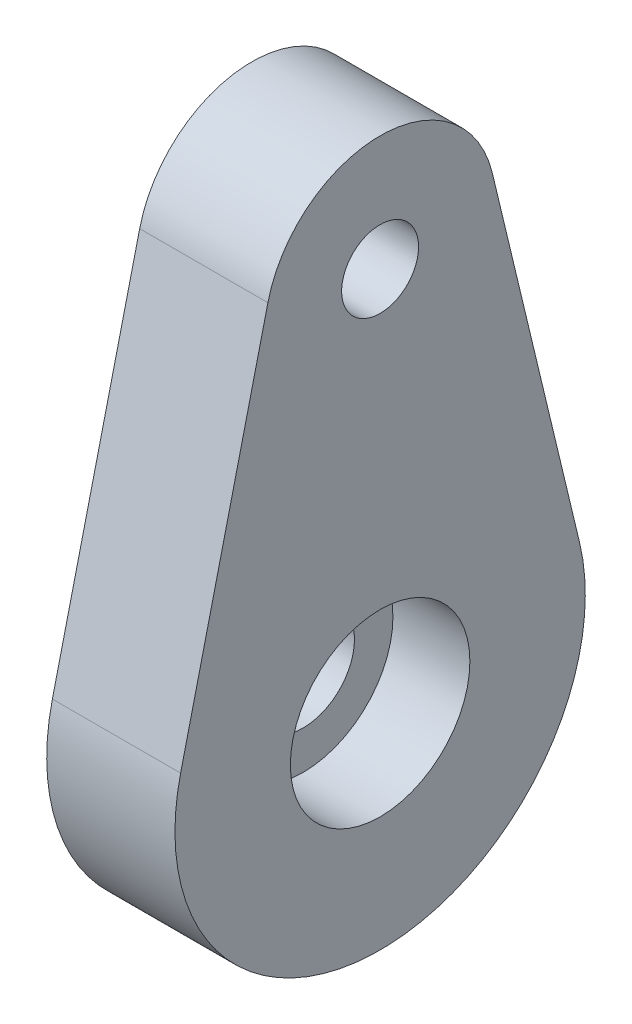
ISO-10303-21;
HEADER;
FILE_DESCRIPTION(('STEP AP214'),'2;1');
FILE_NAME('part.step','',(''),(''),'','','');
FILE_SCHEMA(('AUTOMOTIVE_DESIGN { 1 0 10303 214 1 1 1 1 }'));
ENDSEC;
DATA;
#1=APPLICATION_CONTEXT('core data for automotive mechanical design processes');
#2=APPLICATION_PROTOCOL_DEFINITION('international standard','automotive_design',2000,#1);
#3=PRODUCT_CONTEXT('',#1,'mechanical');
#4=PRODUCT('Part','Part','',(#3));
#5=PRODUCT_RELATED_PRODUCT_CATEGORY('part','',(#4));
#6=PRODUCT_DEFINITION_FORMATION('','',#4);
#7=PRODUCT_DEFINITION_CONTEXT('part definition',#1,'design');
#8=PRODUCT_DEFINITION('design','',#6,#7);
#9=PRODUCT_DEFINITION_SHAPE('','',#8);
#10=(LENGTH_UNIT() NAMED_UNIT(*) SI_UNIT(.MILLI.,.METRE.));
#11=(NAMED_UNIT(*) PLANE_ANGLE_UNIT() SI_UNIT($,.RADIAN.));
#12=(NAMED_UNIT(*) SI_UNIT($,.STERADIAN.) SOLID_ANGLE_UNIT());
#13=UNCERTAINTY_MEASURE_WITH_UNIT(LENGTH_MEASURE(1.E-05),#10,'distance_accuracy_value','');
#14=(GEOMETRIC_REPRESENTATION_CONTEXT(3) GLOBAL_UNCERTAINTY_ASSIGNED_CONTEXT((#13)) GLOBAL_UNIT_ASSIGNED_CONTEXT((#10,
#11,#12)) REPRESENTATION_CONTEXT('',''));
#15=CARTESIAN_POINT('',(0.,0.,0.));
#16=DIRECTION('',(0.,0.,1.));
#17=DIRECTION('',(1.,0.,0.));
#18=AXIS2_PLACEMENT_3D('',#15,#16,#17);
#19=CARTESIAN_POINT('',(5.,0.,0.));
#20=DIRECTION('',(-1.,0.,0.));
#21=DIRECTION('',(0.,0.,1.));
#22=AXIS2_PLACEMENT_3D('',#19,#20,#21);
#23=CYLINDRICAL_SURFACE('',#22,2.);
#24=CARTESIAN_POINT('',(-0.5,0.,0.));
#25=DIRECTION('',(-1.,0.,0.));
#26=DIRECTION('',(0.,0.,1.));
#27=AXIS2_PLACEMENT_3D('',#24,#25,#26);
#28=CIRCLE('',#27,2.);
#29=CARTESIAN_POINT('',(-0.5,0.,2.));
#30=VERTEX_POINT('',#29);
#31=EDGE_CURVE('E215',#30,#30,#28,.T.);
#32=ORIENTED_EDGE('',*,*,#31,.T.);
#33=EDGE_LOOP('',(#32));
#34=FACE_BOUND('',#33,.T.);
#35=CARTESIAN_POINT('',(2.,0.,0.));
#36=DIRECTION('',(1.,0.,0.));
#37=DIRECTION('',(0.,0.,-1.));
#38=AXIS2_PLACEMENT_3D('',#35,#36,#37);
#39=CIRCLE('',#38,2.);
#40=CARTESIAN_POINT('',(2.,0.,-2.));
#41=VERTEX_POINT('',#40);
#42=EDGE_CURVE('E211',#41,#41,#39,.T.);
#43=ORIENTED_EDGE('',*,*,#42,.T.);
#44=EDGE_LOOP('',(#43));
#45=FACE_BOUND('',#44,.T.);
#46=ADVANCED_FACE('F34',(#34,#45),#23,.F.);
#47=CARTESIAN_POINT('',(0.,0.,0.));
#48=DIRECTION('',(1.,0.,0.));
#49=DIRECTION('',(0.,0.,-1.));
#50=AXIS2_PLACEMENT_3D('',#47,#48,#49);
#51=PLANE('',#50);
#52=CARTESIAN_POINT('',(0.,15.,0.));
#53=DIRECTION('',(1.,0.,0.));
#54=DIRECTION('',(0.,0.,-1.));
#55=AXIS2_PLACEMENT_3D('',#52,#53,#54);
#56=CIRCLE('',#55,1.5);
#57=CARTESIAN_POINT('',(0.,15.,-1.5));
#58=VERTEX_POINT('',#57);
#59=EDGE_CURVE('E226',#58,#58,#56,.T.);
#60=ORIENTED_EDGE('',*,*,#59,.T.);
#61=EDGE_LOOP('',(#60));
#62=FACE_BOUND('',#61,.T.);
#63=CARTESIAN_POINT('',(0.,0.,0.));
#64=DIRECTION('',(1.,0.,0.));
#65=DIRECTION('',(0.,0.,-1.));
#66=AXIS2_PLACEMENT_3D('',#63,#64,#65);
#67=CIRCLE('',#66,8.);
#68=CARTESIAN_POINT('',(0.,1.86666666666667,7.7791744777679));
#69=VERTEX_POINT('',#68);
#70=CARTESIAN_POINT('',(0.,1.86666666666667,-7.77917447776791));
#71=VERTEX_POINT('',#70);
#72=EDGE_CURVE('E102',#69,#71,#67,.T.);
#73=ORIENTED_EDGE('',*,*,#72,.F.);
#74=DIRECTION('',(0.,-0.972396809720988,0.233333333333333));
#75=VECTOR('',#74,1.);
#76=CARTESIAN_POINT('',(0.,1.86666666666667,7.7791744777679));
#77=LINE('',#76,#75);
#78=CARTESIAN_POINT('',(0.,16.05,4.37578564374444));
#79=VERTEX_POINT('',#78);
#80=EDGE_CURVE('E74',#79,#69,#77,.T.);
#81=ORIENTED_EDGE('',*,*,#80,.F.);
#82=CARTESIAN_POINT('',(0.,15.,0.));
#83=DIRECTION('',(1.,0.,0.));
#84=DIRECTION('',(0.,0.,-1.));
#85=AXIS2_PLACEMENT_3D('',#82,#83,#84);
#86=CIRCLE('',#85,4.5);
#87=CARTESIAN_POINT('',(0.,16.05,-4.37578564374445));
#88=VERTEX_POINT('',#87);
#89=EDGE_CURVE('E68',#88,#79,#86,.T.);
#90=ORIENTED_EDGE('',*,*,#89,.F.);
#91=DIRECTION('',(0.,0.972396809720988,0.233333333333333));
#92=VECTOR('',#91,1.);
#93=CARTESIAN_POINT('',(0.,16.05,-4.37578564374445));
#94=LINE('',#93,#92);
#95=EDGE_CURVE('E93',#71,#88,#94,.T.);
#96=ORIENTED_EDGE('',*,*,#95,.F.);
#97=EDGE_LOOP('',(#73,#81,#90,#96));
#98=FACE_BOUND('',#97,.T.);
#99=CARTESIAN_POINT('',(0.,0.,0.));
#100=DIRECTION('',(1.,0.,0.));
#101=DIRECTION('',(0.,0.,-1.));
#102=AXIS2_PLACEMENT_3D('',#99,#100,#101);
#103=CIRCLE('',#102,3.);
#104=CARTESIAN_POINT('',(0.,0.,-3.));
#105=VERTEX_POINT('',#104);
#106=EDGE_CURVE('E11',#105,#105,#103,.F.);
#107=ORIENTED_EDGE('',*,*,#106,.F.);
#108=EDGE_LOOP('',(#107));
#109=FACE_BOUND('',#108,.T.);
#110=ADVANCED_FACE('F113',(#62,#98,#109),#51,.F.);
#111=CARTESIAN_POINT('',(5.,0.,0.));
#112=DIRECTION('',(1.,0.,0.));
#113=DIRECTION('',(0.,0.,-1.));
#114=AXIS2_PLACEMENT_3D('',#111,#112,#113);
#115=PLANE('',#114);
#116=CARTESIAN_POINT('',(5.,0.,0.));
#117=DIRECTION('',(1.,0.,0.));
#118=DIRECTION('',(0.,0.,-1.));
#119=AXIS2_PLACEMENT_3D('',#116,#117,#118);
#120=CIRCLE('',#119,3.5);
#121=CARTESIAN_POINT('',(5.,0.,-3.5));
#122=VERTEX_POINT('',#121);
#123=EDGE_CURVE('E216',#122,#122,#120,.T.);
#124=ORIENTED_EDGE('',*,*,#123,.F.);
#125=EDGE_LOOP('',(#124));
#126=FACE_BOUND('',#125,.T.);
#127=CARTESIAN_POINT('',(5.,0.,0.));
#128=DIRECTION('',(1.,0.,0.));
#129=DIRECTION('',(0.,0.,-1.));
#130=AXIS2_PLACEMENT_3D('',#127,#128,#129);
#131=CIRCLE('',#130,8.);
#132=CARTESIAN_POINT('',(5.,1.86666666666667,7.7791744777679));
#133=VERTEX_POINT('',#132);
#134=CARTESIAN_POINT('',(5.,1.86666666666667,-7.77917447776791));
#135=VERTEX_POINT('',#134);
#136=EDGE_CURVE('E88',#133,#135,#131,.T.);
#137=ORIENTED_EDGE('',*,*,#136,.T.);
#138=DIRECTION('',(0.,0.972396809720988,0.233333333333333));
#139=VECTOR('',#138,1.);
#140=CARTESIAN_POINT('',(5.,16.05,-4.37578564374445));
#141=LINE('',#140,#139);
#142=CARTESIAN_POINT('',(5.,16.05,-4.37578564374445));
#143=VERTEX_POINT('',#142);
#144=EDGE_CURVE('E82',#135,#143,#141,.T.);
#145=ORIENTED_EDGE('',*,*,#144,.T.);
#146=CARTESIAN_POINT('',(5.,15.,0.));
#147=DIRECTION('',(1.,0.,0.));
#148=DIRECTION('',(0.,0.,-1.));
#149=AXIS2_PLACEMENT_3D('',#146,#147,#148);
#150=CIRCLE('',#149,4.5);
#151=CARTESIAN_POINT('',(5.,16.05,4.37578564374444));
#152=VERTEX_POINT('',#151);
#153=EDGE_CURVE('E86',#143,#152,#150,.T.);
#154=ORIENTED_EDGE('',*,*,#153,.T.);
#155=DIRECTION('',(0.,-0.972396809720988,0.233333333333333));
#156=VECTOR('',#155,1.);
#157=CARTESIAN_POINT('',(5.,1.86666666666667,7.7791744777679));
#158=LINE('',#157,#156);
#159=EDGE_CURVE('E51',#152,#133,#158,.T.);
#160=ORIENTED_EDGE('',*,*,#159,.T.);
#161=EDGE_LOOP('',(#137,#145,#154,#160));
#162=FACE_BOUND('',#161,.T.);
#163=CARTESIAN_POINT('',(5.,15.,0.));
#164=DIRECTION('',(1.,0.,0.));
#165=DIRECTION('',(0.,0.,-1.));
#166=AXIS2_PLACEMENT_3D('',#163,#164,#165);
#167=CIRCLE('',#166,1.5);
#168=CARTESIAN_POINT('',(5.,15.,-1.5));
#169=VERTEX_POINT('',#168);
#170=EDGE_CURVE('E105',#169,#169,#167,.T.);
#171=ORIENTED_EDGE('',*,*,#170,.F.);
#172=EDGE_LOOP('',(#171));
#173=FACE_BOUND('',#172,.T.);
#174=ADVANCED_FACE('F83',(#126,#162,#173),#115,.T.);
#175=CARTESIAN_POINT('',(5.,0.,0.));
#176=DIRECTION('',(-1.,0.,0.));
#177=DIRECTION('',(0.,0.,1.));
#178=AXIS2_PLACEMENT_3D('',#175,#176,#177);
#179=CYLINDRICAL_SURFACE('',#178,8.);
#180=ORIENTED_EDGE('',*,*,#72,.T.);
#181=DIRECTION('',(-1.,0.,0.));
#182=VECTOR('',#181,1.);
#183=CARTESIAN_POINT('',(5.,1.86666666666667,-7.77917447776791));
#184=LINE('',#183,#182);
#185=EDGE_CURVE('E43',#135,#71,#184,.T.);
#186=ORIENTED_EDGE('',*,*,#185,.F.);
#187=ORIENTED_EDGE('',*,*,#136,.F.);
#188=DIRECTION('',(-1.,0.,0.));
#189=VECTOR('',#188,1.);
#190=CARTESIAN_POINT('',(5.,1.86666666666667,7.7791744777679));
#191=LINE('',#190,#189);
#192=EDGE_CURVE('E98',#133,#69,#191,.T.);
#193=ORIENTED_EDGE('',*,*,#192,.T.);
#194=EDGE_LOOP('',(#180,#186,#187,#193));
#195=FACE_BOUND('',#194,.T.);
#196=ADVANCED_FACE('F36',(#195),#179,.T.);
#197=CARTESIAN_POINT('',(5.,16.05,-4.37578564374445));
#198=DIRECTION('',(0.,-0.233333333333333,0.972396809720988));
#199=DIRECTION('',(0.,-0.972396809720988,-0.233333333333333));
#200=AXIS2_PLACEMENT_3D('',#197,#198,#199);
#201=PLANE('',#200);
#202=ORIENTED_EDGE('',*,*,#95,.T.);
#203=DIRECTION('',(-1.,0.,0.));
#204=VECTOR('',#203,1.);
#205=CARTESIAN_POINT('',(5.,16.05,-4.37578564374445));
#206=LINE('',#205,#204);
#207=EDGE_CURVE('E91',#143,#88,#206,.T.);
#208=ORIENTED_EDGE('',*,*,#207,.F.);
#209=ORIENTED_EDGE('',*,*,#144,.F.);
#210=ORIENTED_EDGE('',*,*,#185,.T.);
#211=EDGE_LOOP('',(#202,#208,#209,#210));
#212=FACE_BOUND('',#211,.T.);
#213=ADVANCED_FACE('F92',(#212),#201,.F.);
#214=CARTESIAN_POINT('',(5.,15.,0.));
#215=DIRECTION('',(-1.,0.,0.));
#216=DIRECTION('',(0.,0.,1.));
#217=AXIS2_PLACEMENT_3D('',#214,#215,#216);
#218=CYLINDRICAL_SURFACE('',#217,4.5);
#219=ORIENTED_EDGE('',*,*,#89,.T.);
#220=DIRECTION('',(-1.,0.,0.));
#221=VECTOR('',#220,1.);
#222=CARTESIAN_POINT('',(5.,16.05,4.37578564374444));
#223=LINE('',#222,#221);
#224=EDGE_CURVE('E94',#152,#79,#223,.T.);
#225=ORIENTED_EDGE('',*,*,#224,.F.);
#226=ORIENTED_EDGE('',*,*,#153,.F.);
#227=ORIENTED_EDGE('',*,*,#207,.T.);
#228=EDGE_LOOP('',(#219,#225,#226,#227));
#229=FACE_BOUND('',#228,.T.);
#230=ADVANCED_FACE('F96',(#229),#218,.T.);
#231=CARTESIAN_POINT('',(5.,1.86666666666667,7.7791744777679));
#232=DIRECTION('',(0.,-0.233333333333333,-0.972396809720988));
#233=DIRECTION('',(0.,0.972396809720988,-0.233333333333333));
#234=AXIS2_PLACEMENT_3D('',#231,#232,#233);
#235=PLANE('',#234);
#236=ORIENTED_EDGE('',*,*,#80,.T.);
#237=ORIENTED_EDGE('',*,*,#192,.F.);
#238=ORIENTED_EDGE('',*,*,#159,.F.);
#239=ORIENTED_EDGE('',*,*,#224,.T.);
#240=EDGE_LOOP('',(#236,#237,#238,#239));
#241=FACE_BOUND('',#240,.T.);
#242=ADVANCED_FACE('F149',(#241),#235,.F.);
#243=CARTESIAN_POINT('',(5.,15.,0.));
#244=DIRECTION('',(-1.,0.,0.));
#245=DIRECTION('',(0.,0.,1.));
#246=AXIS2_PLACEMENT_3D('',#243,#244,#245);
#247=CYLINDRICAL_SURFACE('',#246,1.5);
#248=ORIENTED_EDGE('',*,*,#170,.T.);
#249=EDGE_LOOP('',(#248));
#250=FACE_BOUND('',#249,.T.);
#251=ORIENTED_EDGE('',*,*,#59,.F.);
#252=EDGE_LOOP('',(#251));
#253=FACE_BOUND('',#252,.T.);
#254=ADVANCED_FACE('F133',(#250,#253),#247,.F.);
#255=CARTESIAN_POINT('',(-0.5,0.,0.));
#256=DIRECTION('',(-1.,0.,0.));
#257=DIRECTION('',(0.,0.,1.));
#258=AXIS2_PLACEMENT_3D('',#255,#256,#257);
#259=PLANE('',#258);
#260=CARTESIAN_POINT('',(-0.5,0.,0.));
#261=DIRECTION('',(-1.,0.,0.));
#262=DIRECTION('',(0.,0.,1.));
#263=AXIS2_PLACEMENT_3D('',#260,#261,#262);
#264=CIRCLE('',#263,3.);
#265=CARTESIAN_POINT('',(-0.5,0.,3.));
#266=VERTEX_POINT('',#265);
#267=EDGE_CURVE('E218',#266,#266,#264,.T.);
#268=ORIENTED_EDGE('',*,*,#267,.T.);
#269=EDGE_LOOP('',(#268));
#270=FACE_BOUND('',#269,.T.);
#271=ORIENTED_EDGE('',*,*,#31,.F.);
#272=EDGE_LOOP('',(#271));
#273=FACE_BOUND('',#272,.T.);
#274=ADVANCED_FACE('F123',(#270,#273),#259,.T.);
#275=CARTESIAN_POINT('',(-0.5,0.,0.));
#276=DIRECTION('',(1.,0.,0.));
#277=DIRECTION('',(0.,0.,-1.));
#278=AXIS2_PLACEMENT_3D('',#275,#276,#277);
#279=CYLINDRICAL_SURFACE('',#278,3.);
#280=ORIENTED_EDGE('',*,*,#267,.F.);
#281=EDGE_LOOP('',(#280));
#282=FACE_BOUND('',#281,.T.);
#283=ORIENTED_EDGE('',*,*,#106,.T.);
#284=EDGE_LOOP('',(#283));
#285=FACE_BOUND('',#284,.T.);
#286=ADVANCED_FACE('F120',(#282,#285),#279,.T.);
#287=CARTESIAN_POINT('',(2.,0.,0.));
#288=DIRECTION('',(1.,0.,0.));
#289=DIRECTION('',(0.,0.,-1.));
#290=AXIS2_PLACEMENT_3D('',#287,#288,#289);
#291=CYLINDRICAL_SURFACE('',#290,3.5);
#292=CARTESIAN_POINT('',(2.,0.,0.));
#293=DIRECTION('',(1.,0.,0.));
#294=DIRECTION('',(0.,0.,-1.));
#295=AXIS2_PLACEMENT_3D('',#292,#293,#294);
#296=CIRCLE('',#295,3.5);
#297=CARTESIAN_POINT('',(2.,0.,-3.5));
#298=VERTEX_POINT('',#297);
#299=EDGE_CURVE('E214',#298,#298,#296,.T.);
#300=ORIENTED_EDGE('',*,*,#299,.F.);
#301=EDGE_LOOP('',(#300));
#302=FACE_BOUND('',#301,.T.);
#303=ORIENTED_EDGE('',*,*,#123,.T.);
#304=EDGE_LOOP('',(#303));
#305=FACE_BOUND('',#304,.T.);
#306=ADVANCED_FACE('F122',(#302,#305),#291,.F.);
#307=CARTESIAN_POINT('',(2.,0.,0.));
#308=DIRECTION('',(1.,0.,0.));
#309=DIRECTION('',(0.,0.,-1.));
#310=AXIS2_PLACEMENT_3D('',#307,#308,#309);
#311=PLANE('',#310);
#312=ORIENTED_EDGE('',*,*,#42,.F.);
#313=EDGE_LOOP('',(#312));
#314=FACE_BOUND('',#313,.T.);
#315=ORIENTED_EDGE('',*,*,#299,.T.);
#316=EDGE_LOOP('',(#315));
#317=FACE_BOUND('',#316,.T.);
#318=ADVANCED_FACE('F130',(#314,#317),#311,.T.);
#319=CLOSED_SHELL('',(#46,#110,#174,#196,#213,#230,#242,#254,#274,#286,#306,#318));
#320=MANIFOLD_SOLID_BREP('B2',#319);
#321=ADVANCED_BREP_SHAPE_REPRESENTATION('',(#18,#320),#14);
#322=SHAPE_DEFINITION_REPRESENTATION(#9,#321);
ENDSEC;
END-ISO-10303-21;
